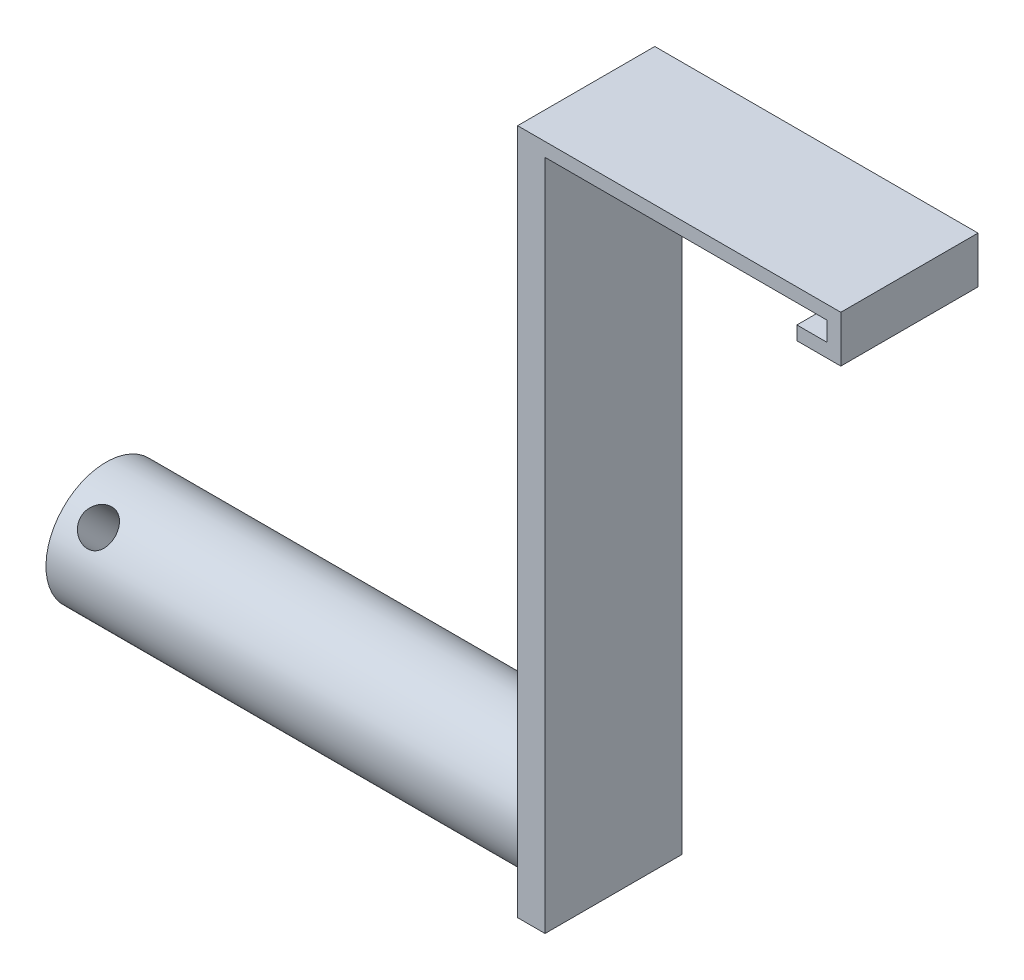
ISO-10303-21;
HEADER;
FILE_DESCRIPTION(('STEP AP214'),'2;1');
FILE_NAME('part.step','',(''),(''),'','','');
FILE_SCHEMA(('AUTOMOTIVE_DESIGN { 1 0 10303 214 1 1 1 1 }'));
ENDSEC;
DATA;
#1=APPLICATION_CONTEXT('core data for automotive mechanical design processes');
#2=APPLICATION_PROTOCOL_DEFINITION('international standard','automotive_design',2000,#1);
#3=PRODUCT_CONTEXT('',#1,'mechanical');
#4=PRODUCT('Part','Part','',(#3));
#5=PRODUCT_RELATED_PRODUCT_CATEGORY('part','',(#4));
#6=PRODUCT_DEFINITION_FORMATION('','',#4);
#7=PRODUCT_DEFINITION_CONTEXT('part definition',#1,'design');
#8=PRODUCT_DEFINITION('design','',#6,#7);
#9=PRODUCT_DEFINITION_SHAPE('','',#8);
#10=(LENGTH_UNIT() NAMED_UNIT(*) SI_UNIT(.MILLI.,.METRE.));
#11=(NAMED_UNIT(*) PLANE_ANGLE_UNIT() SI_UNIT($,.RADIAN.));
#12=(NAMED_UNIT(*) SI_UNIT($,.STERADIAN.) SOLID_ANGLE_UNIT());
#13=UNCERTAINTY_MEASURE_WITH_UNIT(LENGTH_MEASURE(1.E-05),#10,'distance_accuracy_value','');
#14=(GEOMETRIC_REPRESENTATION_CONTEXT(3) GLOBAL_UNCERTAINTY_ASSIGNED_CONTEXT((#13)) GLOBAL_UNIT_ASSIGNED_CONTEXT((#10,
#11,#12)) REPRESENTATION_CONTEXT('',''));
#15=CARTESIAN_POINT('',(0.,0.,0.));
#16=DIRECTION('',(0.,0.,1.));
#17=DIRECTION('',(1.,0.,0.));
#18=AXIS2_PLACEMENT_3D('',#15,#16,#17);
#19=CARTESIAN_POINT('',(0.,-2.54,25.4));
#20=DIRECTION('',(1.,0.,0.));
#21=DIRECTION('',(0.,0.,-1.));
#22=AXIS2_PLACEMENT_3D('',#19,#20,#21);
#23=PLANE('',#22);
#24=DIRECTION('',(0.,-1.,0.));
#25=VECTOR('',#24,1.);
#26=CARTESIAN_POINT('',(0.,-2.54,0.));
#27=LINE('',#26,#25);
#28=CARTESIAN_POINT('',(0.,0.,0.));
#29=VERTEX_POINT('',#28);
#30=CARTESIAN_POINT('',(0.,-2.54,0.));
#31=VERTEX_POINT('',#30);
#32=EDGE_CURVE('E151',#29,#31,#27,.T.);
#33=ORIENTED_EDGE('',*,*,#32,.T.);
#34=DIRECTION('',(0.,0.,-1.));
#35=VECTOR('',#34,1.);
#36=CARTESIAN_POINT('',(0.,-2.54,25.4));
#37=LINE('',#36,#35);
#38=CARTESIAN_POINT('',(0.,-2.54,25.4));
#39=VERTEX_POINT('',#38);
#40=EDGE_CURVE('E48',#39,#31,#37,.T.);
#41=ORIENTED_EDGE('',*,*,#40,.F.);
#42=DIRECTION('',(0.,-1.,0.));
#43=VECTOR('',#42,1.);
#44=CARTESIAN_POINT('',(0.,-2.54,25.4));
#45=LINE('',#44,#43);
#46=CARTESIAN_POINT('',(0.,0.,25.4));
#47=VERTEX_POINT('',#46);
#48=EDGE_CURVE('E171',#47,#39,#45,.T.);
#49=ORIENTED_EDGE('',*,*,#48,.F.);
#50=DIRECTION('',(0.,0.,-1.));
#51=VECTOR('',#50,1.);
#52=CARTESIAN_POINT('',(0.,0.,25.4));
#53=LINE('',#52,#51);
#54=EDGE_CURVE('E147',#47,#29,#53,.T.);
#55=ORIENTED_EDGE('',*,*,#54,.T.);
#56=EDGE_LOOP('',(#33,#41,#49,#55));
#57=FACE_BOUND('',#56,.T.);
#58=ADVANCED_FACE('F35',(#57),#23,.F.);
#59=CARTESIAN_POINT('',(8.128,-2.54,25.4));
#60=DIRECTION('',(0.,1.,0.));
#61=DIRECTION('',(-1.,0.,0.));
#62=AXIS2_PLACEMENT_3D('',#59,#60,#61);
#63=PLANE('',#62);
#64=DIRECTION('',(1.,0.,0.));
#65=VECTOR('',#64,1.);
#66=CARTESIAN_POINT('',(8.128,-2.54,0.));
#67=LINE('',#66,#65);
#68=CARTESIAN_POINT('',(8.128,-2.54,0.));
#69=VERTEX_POINT('',#68);
#70=EDGE_CURVE('E154',#31,#69,#67,.T.);
#71=ORIENTED_EDGE('',*,*,#70,.T.);
#72=DIRECTION('',(0.,0.,-1.));
#73=VECTOR('',#72,1.);
#74=CARTESIAN_POINT('',(8.128,-2.54,25.4));
#75=LINE('',#74,#73);
#76=CARTESIAN_POINT('',(8.128,-2.54,25.4));
#77=VERTEX_POINT('',#76);
#78=EDGE_CURVE('E188',#77,#69,#75,.T.);
#79=ORIENTED_EDGE('',*,*,#78,.F.);
#80=DIRECTION('',(1.,0.,0.));
#81=VECTOR('',#80,1.);
#82=CARTESIAN_POINT('',(8.128,-2.54,25.4));
#83=LINE('',#82,#81);
#84=EDGE_CURVE('E107',#39,#77,#83,.T.);
#85=ORIENTED_EDGE('',*,*,#84,.F.);
#86=ORIENTED_EDGE('',*,*,#40,.T.);
#87=EDGE_LOOP('',(#71,#79,#85,#86));
#88=FACE_BOUND('',#87,.T.);
#89=ADVANCED_FACE('F212',(#88),#63,.F.);
#90=CARTESIAN_POINT('',(8.128,6.09599999999999,25.4));
#91=DIRECTION('',(-1.,0.,0.));
#92=DIRECTION('',(0.,-1.,0.));
#93=AXIS2_PLACEMENT_3D('',#90,#91,#92);
#94=PLANE('',#93);
#95=DIRECTION('',(0.,1.,0.));
#96=VECTOR('',#95,1.);
#97=CARTESIAN_POINT('',(8.128,6.09599999999999,0.));
#98=LINE('',#97,#96);
#99=CARTESIAN_POINT('',(8.128,6.09599999999999,0.));
#100=VERTEX_POINT('',#99);
#101=EDGE_CURVE('E157',#69,#100,#98,.T.);
#102=ORIENTED_EDGE('',*,*,#101,.T.);
#103=DIRECTION('',(0.,0.,-1.));
#104=VECTOR('',#103,1.);
#105=CARTESIAN_POINT('',(8.128,6.09599999999999,25.4));
#106=LINE('',#105,#104);
#107=CARTESIAN_POINT('',(8.128,6.09599999999999,25.4));
#108=VERTEX_POINT('',#107);
#109=EDGE_CURVE('E185',#108,#100,#106,.T.);
#110=ORIENTED_EDGE('',*,*,#109,.F.);
#111=DIRECTION('',(0.,1.,0.));
#112=VECTOR('',#111,1.);
#113=CARTESIAN_POINT('',(8.128,6.09599999999999,25.4));
#114=LINE('',#113,#112);
#115=EDGE_CURVE('E227',#77,#108,#114,.T.);
#116=ORIENTED_EDGE('',*,*,#115,.F.);
#117=ORIENTED_EDGE('',*,*,#78,.T.);
#118=EDGE_LOOP('',(#102,#110,#116,#117));
#119=FACE_BOUND('',#118,.T.);
#120=ADVANCED_FACE('F217',(#119),#94,.F.);
#121=CARTESIAN_POINT('',(-51.7144,6.09599999999999,25.4));
#122=DIRECTION('',(0.,-1.,0.));
#123=DIRECTION('',(0.,0.,-1.));
#124=AXIS2_PLACEMENT_3D('',#121,#122,#123);
#125=PLANE('',#124);
#126=DIRECTION('',(-1.,0.,0.));
#127=VECTOR('',#126,1.);
#128=CARTESIAN_POINT('',(-51.7144,6.09599999999999,0.));
#129=LINE('',#128,#127);
#130=CARTESIAN_POINT('',(-51.7144,6.09599999999999,0.));
#131=VERTEX_POINT('',#130);
#132=EDGE_CURVE('E159',#100,#131,#129,.T.);
#133=ORIENTED_EDGE('',*,*,#132,.T.);
#134=DIRECTION('',(0.,0.,-1.));
#135=VECTOR('',#134,1.);
#136=CARTESIAN_POINT('',(-51.7144,6.09599999999999,25.4));
#137=LINE('',#136,#135);
#138=CARTESIAN_POINT('',(-51.7144,6.09599999999999,25.4));
#139=VERTEX_POINT('',#138);
#140=EDGE_CURVE('E182',#139,#131,#137,.T.);
#141=ORIENTED_EDGE('',*,*,#140,.F.);
#142=DIRECTION('',(-1.,0.,0.));
#143=VECTOR('',#142,1.);
#144=CARTESIAN_POINT('',(-51.7144,6.09599999999999,25.4));
#145=LINE('',#144,#143);
#146=EDGE_CURVE('E229',#108,#139,#145,.T.);
#147=ORIENTED_EDGE('',*,*,#146,.F.);
#148=ORIENTED_EDGE('',*,*,#109,.T.);
#149=EDGE_LOOP('',(#133,#141,#147,#148));
#150=FACE_BOUND('',#149,.T.);
#151=ADVANCED_FACE('F255',(#150),#125,.F.);
#152=CARTESIAN_POINT('',(-51.7144,-120.904,25.4));
#153=DIRECTION('',(1.,0.,0.));
#154=DIRECTION('',(0.,1.,0.));
#155=AXIS2_PLACEMENT_3D('',#152,#153,#154);
#156=PLANE('',#155);
#157=DIRECTION('',(0.,0.,-1.));
#158=VECTOR('',#157,1.);
#159=CARTESIAN_POINT('',(-51.7144,-120.904,25.4));
#160=LINE('',#159,#158);
#161=CARTESIAN_POINT('',(-51.7144,-120.904,12.7));
#162=VERTEX_POINT('',#161);
#163=CARTESIAN_POINT('',(-51.7144,-120.904,0.));
#164=VERTEX_POINT('',#163);
#165=EDGE_CURVE('E178',#162,#164,#160,.T.);
#166=ORIENTED_EDGE('',*,*,#165,.F.);
#167=CARTESIAN_POINT('',(-51.7144,-109.7788,12.7));
#168=DIRECTION('',(-1.,0.,0.));
#169=DIRECTION('',(0.,-1.,0.));
#170=AXIS2_PLACEMENT_3D('',#167,#168,#169);
#171=CIRCLE('',#170,11.1252);
#172=EDGE_CURVE('E363',#162,#162,#171,.T.);
#173=ORIENTED_EDGE('',*,*,#172,.F.);
#174=CARTESIAN_POINT('',(-51.7144,-120.904,25.4));
#175=VERTEX_POINT('',#174);
#176=EDGE_CURVE('E179',#175,#162,#160,.T.);
#177=ORIENTED_EDGE('',*,*,#176,.F.);
#178=DIRECTION('',(0.,-1.,0.));
#179=VECTOR('',#178,1.);
#180=CARTESIAN_POINT('',(-51.7144,-120.904,25.4));
#181=LINE('',#180,#179);
#182=EDGE_CURVE('E231',#139,#175,#181,.T.);
#183=ORIENTED_EDGE('',*,*,#182,.F.);
#184=ORIENTED_EDGE('',*,*,#140,.T.);
#185=DIRECTION('',(0.,-1.,0.));
#186=VECTOR('',#185,1.);
#187=CARTESIAN_POINT('',(-51.7144,-120.904,0.));
#188=LINE('',#187,#186);
#189=EDGE_CURVE('E161',#131,#164,#188,.T.);
#190=ORIENTED_EDGE('',*,*,#189,.T.);
#191=EDGE_LOOP('',(#166,#173,#177,#183,#184,#190));
#192=FACE_BOUND('',#191,.T.);
#193=ADVANCED_FACE('F251',(#192),#156,.F.);
#194=CARTESIAN_POINT('',(-46.6344,-120.904,25.4));
#195=DIRECTION('',(0.,1.,0.));
#196=DIRECTION('',(0.,0.,1.));
#197=AXIS2_PLACEMENT_3D('',#194,#195,#196);
#198=PLANE('',#197);
#199=DIRECTION('',(1.,0.,0.));
#200=VECTOR('',#199,1.);
#201=CARTESIAN_POINT('',(-46.6344,-120.904,0.));
#202=LINE('',#201,#200);
#203=CARTESIAN_POINT('',(-46.6344,-120.904,0.));
#204=VERTEX_POINT('',#203);
#205=EDGE_CURVE('E164',#164,#204,#202,.T.);
#206=ORIENTED_EDGE('',*,*,#205,.T.);
#207=DIRECTION('',(0.,0.,-1.));
#208=VECTOR('',#207,1.);
#209=CARTESIAN_POINT('',(-46.6344,-120.904,25.4));
#210=LINE('',#209,#208);
#211=CARTESIAN_POINT('',(-46.6344,-120.904,25.4));
#212=VERTEX_POINT('',#211);
#213=EDGE_CURVE('E175',#212,#204,#210,.T.);
#214=ORIENTED_EDGE('',*,*,#213,.F.);
#215=DIRECTION('',(1.,0.,0.));
#216=VECTOR('',#215,1.);
#217=CARTESIAN_POINT('',(-46.6344,-120.904,25.4));
#218=LINE('',#217,#216);
#219=EDGE_CURVE('E237',#175,#212,#218,.T.);
#220=ORIENTED_EDGE('',*,*,#219,.F.);
#221=ORIENTED_EDGE('',*,*,#176,.T.);
#222=ORIENTED_EDGE('',*,*,#165,.T.);
#223=EDGE_LOOP('',(#206,#214,#220,#221,#222));
#224=FACE_BOUND('',#223,.T.);
#225=ADVANCED_FACE('F243',(#224),#198,.F.);
#226=CARTESIAN_POINT('',(-46.6344,3.55599999999998,25.4));
#227=DIRECTION('',(-1.,0.,0.));
#228=DIRECTION('',(0.,-1.,0.));
#229=AXIS2_PLACEMENT_3D('',#226,#227,#228);
#230=PLANE('',#229);
#231=DIRECTION('',(0.,1.,0.));
#232=VECTOR('',#231,1.);
#233=CARTESIAN_POINT('',(-46.6344,3.55599999999998,0.));
#234=LINE('',#233,#232);
#235=CARTESIAN_POINT('',(-46.6344,3.55599999999998,0.));
#236=VERTEX_POINT('',#235);
#237=EDGE_CURVE('E166',#204,#236,#234,.T.);
#238=ORIENTED_EDGE('',*,*,#237,.T.);
#239=DIRECTION('',(0.,0.,-1.));
#240=VECTOR('',#239,1.);
#241=CARTESIAN_POINT('',(-46.6344,3.55599999999998,25.4));
#242=LINE('',#241,#240);
#243=CARTESIAN_POINT('',(-46.6344,3.55599999999998,25.4));
#244=VERTEX_POINT('',#243);
#245=EDGE_CURVE('E142',#244,#236,#242,.T.);
#246=ORIENTED_EDGE('',*,*,#245,.F.);
#247=DIRECTION('',(0.,1.,0.));
#248=VECTOR('',#247,1.);
#249=CARTESIAN_POINT('',(-46.6344,3.55599999999998,25.4));
#250=LINE('',#249,#248);
#251=EDGE_CURVE('E133',#212,#244,#250,.T.);
#252=ORIENTED_EDGE('',*,*,#251,.F.);
#253=ORIENTED_EDGE('',*,*,#213,.T.);
#254=EDGE_LOOP('',(#238,#246,#252,#253));
#255=FACE_BOUND('',#254,.T.);
#256=ADVANCED_FACE('F247',(#255),#230,.F.);
#257=CARTESIAN_POINT('',(5.588,3.55599999999999,25.4));
#258=DIRECTION('',(0.,1.,0.));
#259=DIRECTION('',(-1.,0.,0.));
#260=AXIS2_PLACEMENT_3D('',#257,#258,#259);
#261=PLANE('',#260);
#262=DIRECTION('',(1.,0.,0.));
#263=VECTOR('',#262,1.);
#264=CARTESIAN_POINT('',(5.588,3.55599999999999,0.));
#265=LINE('',#264,#263);
#266=CARTESIAN_POINT('',(5.588,3.55599999999999,0.));
#267=VERTEX_POINT('',#266);
#268=EDGE_CURVE('E141',#236,#267,#265,.T.);
#269=ORIENTED_EDGE('',*,*,#268,.T.);
#270=DIRECTION('',(0.,0.,-1.));
#271=VECTOR('',#270,1.);
#272=CARTESIAN_POINT('',(5.588,3.55599999999999,25.4));
#273=LINE('',#272,#271);
#274=CARTESIAN_POINT('',(5.588,3.55599999999999,25.4));
#275=VERTEX_POINT('',#274);
#276=EDGE_CURVE('E138',#275,#267,#273,.T.);
#277=ORIENTED_EDGE('',*,*,#276,.F.);
#278=DIRECTION('',(1.,0.,0.));
#279=VECTOR('',#278,1.);
#280=CARTESIAN_POINT('',(5.588,3.55599999999999,25.4));
#281=LINE('',#280,#279);
#282=EDGE_CURVE('E127',#244,#275,#281,.T.);
#283=ORIENTED_EDGE('',*,*,#282,.F.);
#284=ORIENTED_EDGE('',*,*,#245,.T.);
#285=EDGE_LOOP('',(#269,#277,#283,#284));
#286=FACE_BOUND('',#285,.T.);
#287=ADVANCED_FACE('F139',(#286),#261,.F.);
#288=CARTESIAN_POINT('',(5.588,0.,25.4));
#289=DIRECTION('',(1.,0.,0.));
#290=DIRECTION('',(0.,1.,0.));
#291=AXIS2_PLACEMENT_3D('',#288,#289,#290);
#292=PLANE('',#291);
#293=DIRECTION('',(0.,-1.,0.));
#294=VECTOR('',#293,1.);
#295=CARTESIAN_POINT('',(5.588,0.,0.));
#296=LINE('',#295,#294);
#297=CARTESIAN_POINT('',(5.588,0.,0.));
#298=VERTEX_POINT('',#297);
#299=EDGE_CURVE('E92',#267,#298,#296,.T.);
#300=ORIENTED_EDGE('',*,*,#299,.T.);
#301=DIRECTION('',(0.,0.,-1.));
#302=VECTOR('',#301,1.);
#303=CARTESIAN_POINT('',(5.588,0.,25.4));
#304=LINE('',#303,#302);
#305=CARTESIAN_POINT('',(5.588,0.,25.4));
#306=VERTEX_POINT('',#305);
#307=EDGE_CURVE('E143',#306,#298,#304,.T.);
#308=ORIENTED_EDGE('',*,*,#307,.F.);
#309=DIRECTION('',(0.,-1.,0.));
#310=VECTOR('',#309,1.);
#311=CARTESIAN_POINT('',(5.588,0.,25.4));
#312=LINE('',#311,#310);
#313=EDGE_CURVE('E131',#275,#306,#312,.T.);
#314=ORIENTED_EDGE('',*,*,#313,.F.);
#315=ORIENTED_EDGE('',*,*,#276,.T.);
#316=EDGE_LOOP('',(#300,#308,#314,#315));
#317=FACE_BOUND('',#316,.T.);
#318=ADVANCED_FACE('F145',(#317),#292,.F.);
#319=CARTESIAN_POINT('',(0.,0.,25.4));
#320=DIRECTION('',(0.,-1.,0.));
#321=DIRECTION('',(0.,0.,-1.));
#322=AXIS2_PLACEMENT_3D('',#319,#320,#321);
#323=PLANE('',#322);
#324=DIRECTION('',(-1.,0.,0.));
#325=VECTOR('',#324,1.);
#326=CARTESIAN_POINT('',(0.,0.,0.));
#327=LINE('',#326,#325);
#328=EDGE_CURVE('E98',#298,#29,#327,.T.);
#329=ORIENTED_EDGE('',*,*,#328,.T.);
#330=ORIENTED_EDGE('',*,*,#54,.F.);
#331=DIRECTION('',(-1.,0.,0.));
#332=VECTOR('',#331,1.);
#333=CARTESIAN_POINT('',(0.,0.,25.4));
#334=LINE('',#333,#332);
#335=EDGE_CURVE('E56',#306,#47,#334,.T.);
#336=ORIENTED_EDGE('',*,*,#335,.F.);
#337=ORIENTED_EDGE('',*,*,#307,.T.);
#338=EDGE_LOOP('',(#329,#330,#336,#337));
#339=FACE_BOUND('',#338,.T.);
#340=ADVANCED_FACE('F273',(#339),#323,.F.);
#341=CARTESIAN_POINT('',(0.,0.,25.4));
#342=DIRECTION('',(0.,0.,-1.));
#343=DIRECTION('',(-1.,0.,0.));
#344=AXIS2_PLACEMENT_3D('',#341,#342,#343);
#345=PLANE('',#344);
#346=ORIENTED_EDGE('',*,*,#48,.T.);
#347=ORIENTED_EDGE('',*,*,#84,.T.);
#348=ORIENTED_EDGE('',*,*,#115,.T.);
#349=ORIENTED_EDGE('',*,*,#146,.T.);
#350=ORIENTED_EDGE('',*,*,#182,.T.);
#351=ORIENTED_EDGE('',*,*,#219,.T.);
#352=ORIENTED_EDGE('',*,*,#251,.T.);
#353=ORIENTED_EDGE('',*,*,#282,.T.);
#354=ORIENTED_EDGE('',*,*,#313,.T.);
#355=ORIENTED_EDGE('',*,*,#335,.T.);
#356=EDGE_LOOP('',(#346,#347,#348,#349,#350,#351,#352,#353,#354,#355));
#357=FACE_BOUND('',#356,.T.);
#358=ADVANCED_FACE('F129',(#357),#345,.F.);
#359=CARTESIAN_POINT('',(0.,0.,0.));
#360=DIRECTION('',(0.,0.,-1.));
#361=DIRECTION('',(-1.,0.,0.));
#362=AXIS2_PLACEMENT_3D('',#359,#360,#361);
#363=PLANE('',#362);
#364=ORIENTED_EDGE('',*,*,#32,.F.);
#365=ORIENTED_EDGE('',*,*,#328,.F.);
#366=ORIENTED_EDGE('',*,*,#299,.F.);
#367=ORIENTED_EDGE('',*,*,#268,.F.);
#368=ORIENTED_EDGE('',*,*,#237,.F.);
#369=ORIENTED_EDGE('',*,*,#205,.F.);
#370=ORIENTED_EDGE('',*,*,#189,.F.);
#371=ORIENTED_EDGE('',*,*,#132,.F.);
#372=ORIENTED_EDGE('',*,*,#101,.F.);
#373=ORIENTED_EDGE('',*,*,#70,.F.);
#374=EDGE_LOOP('',(#364,#365,#366,#367,#368,#369,#370,#371,#372,#373));
#375=FACE_BOUND('',#374,.T.);
#376=ADVANCED_FACE('F208',(#375),#363,.T.);
#377=CARTESIAN_POINT('',(-140.6144,-109.7788,12.7));
#378=DIRECTION('',(1.,0.,0.));
#379=DIRECTION('',(0.,1.,0.));
#380=AXIS2_PLACEMENT_3D('',#377,#378,#379);
#381=CYLINDRICAL_SURFACE('',#380,11.1252);
#382=CARTESIAN_POINT('',(-134.2644,-119.563408115953,7.40551994458148));
#383=CARTESIAN_POINT('',(-134.090001550706,-119.563407614243,7.40551597315297));
#384=CARTESIAN_POINT('',(-133.91557110886,-119.556271588709,7.39226615864977));
#385=CARTESIAN_POINT('',(-133.571781849876,-119.527715645985,7.34000204409121));
#386=CARTESIAN_POINT('',(-133.40242513351,-119.506289895277,7.30097722192628));
#387=CARTESIAN_POINT('',(-133.073807956537,-119.449172467906,7.1993330580408));
#388=CARTESIAN_POINT('',(-132.914532328844,-119.413502842267,7.13675019520458));
#389=CARTESIAN_POINT('',(-132.609864312679,-119.327860740213,6.99100446635465));
#390=CARTESIAN_POINT('',(-132.464473565519,-119.277886575662,6.90783917148278));
#391=CARTESIAN_POINT('',(-132.187538802828,-119.162147908142,6.72211518671356));
#392=CARTESIAN_POINT('',(-132.05645128786,-119.096007748252,6.61910975566576));
#393=CARTESIAN_POINT('',(-131.81589619582,-118.948838545607,6.39937076459404));
#394=CARTESIAN_POINT('',(-131.706431144998,-118.867807765245,6.28263560300291));
#395=CARTESIAN_POINT('',(-131.510281675772,-118.689783179352,6.03758486772901));
#396=CARTESIAN_POINT('',(-131.424057468593,-118.592521160314,5.90909465617599));
#397=CARTESIAN_POINT('',(-131.279849621418,-118.384465308768,5.64730482856858));
#398=CARTESIAN_POINT('',(-131.221860496283,-118.273674109763,5.51400615204768));
#399=CARTESIAN_POINT('',(-131.137264563591,-118.043878616905,5.25095690125879));
#400=CARTESIAN_POINT('',(-131.109879731295,-117.925163391741,5.12120433980782));
#401=CARTESIAN_POINT('',(-131.084815183471,-117.680141644676,4.86609105543865));
#402=CARTESIAN_POINT('',(-131.087129802216,-117.553836575255,4.74072949942931));
#403=CARTESIAN_POINT('',(-131.12086460044,-117.301210596418,4.50165822713473));
#404=CARTESIAN_POINT('',(-131.151443158712,-117.174995270355,4.38771669662732));
#405=CARTESIAN_POINT('',(-131.239469884216,-116.923032244499,4.170185219977));
#406=CARTESIAN_POINT('',(-131.296919684717,-116.797284573598,4.06659590351957));
#407=CARTESIAN_POINT('',(-131.43766145281,-116.549054224731,3.87055822318716));
#408=CARTESIAN_POINT('',(-131.521228701823,-116.426622179709,3.77824383608282));
#409=CARTESIAN_POINT('',(-131.71161854045,-116.190672787193,3.60718796067656));
#410=CARTESIAN_POINT('',(-131.818446216462,-116.07715739692,3.52844944779276));
#411=CARTESIAN_POINT('',(-132.056736858803,-115.85937018696,3.38256805190501));
#412=CARTESIAN_POINT('',(-132.188931492214,-115.755561245043,3.31592776564124));
#413=CARTESIAN_POINT('',(-132.471921173663,-115.566159284514,3.19794588892509));
#414=CARTESIAN_POINT('',(-132.622717722279,-115.480567736981,3.14660553382926));
#415=CARTESIAN_POINT('',(-132.940283408954,-115.330954068442,3.05887584288236));
#416=CARTESIAN_POINT('',(-133.107169991318,-115.267108822047,3.02260860427036));
#417=CARTESIAN_POINT('',(-133.451176292511,-115.165336398012,2.96558979009132));
#418=CARTESIAN_POINT('',(-133.628293025617,-115.127401699282,2.9448337119143));
#419=CARTESIAN_POINT('',(-133.981284709674,-115.080453180907,2.91924113361788));
#420=CARTESIAN_POINT('',(-134.156997512398,-115.070500826524,2.91388787003844));
#421=CARTESIAN_POINT('',(-134.507727688189,-115.077394393787,2.91761838858923));
#422=CARTESIAN_POINT('',(-134.682745145057,-115.094236981503,2.92670037462998));
#423=CARTESIAN_POINT('',(-135.022974567152,-115.153064508809,2.95893096609568));
#424=CARTESIAN_POINT('',(-135.188319171625,-115.19446666246,2.98175369277514));
#425=CARTESIAN_POINT('',(-135.509037623214,-115.299805851781,3.04121107201979));
#426=CARTESIAN_POINT('',(-135.664410030127,-115.363746133831,3.07784771438702));
#427=CARTESIAN_POINT('',(-135.965013213394,-115.513039134277,3.16604756401118));
#428=CARTESIAN_POINT('',(-136.109898787841,-115.598881640854,3.2179570413367));
#429=CARTESIAN_POINT('',(-136.381645248601,-115.787445520046,3.33631363061016));
#430=CARTESIAN_POINT('',(-136.50850222708,-115.890170541699,3.40276388647704));
#431=CARTESIAN_POINT('',(-136.744987259621,-116.11219043676,3.55250131771331));
#432=CARTESIAN_POINT('',(-136.85389103577,-116.231926898044,3.63628023521569));
#433=CARTESIAN_POINT('',(-137.046009637089,-116.480517257763,3.81851496224108));
#434=CARTESIAN_POINT('',(-137.129225805959,-116.609370678862,3.91697000366711));
#435=CARTESIAN_POINT('',(-137.266812980345,-116.870372450615,4.12635309765307));
#436=CARTESIAN_POINT('',(-137.321402290397,-117.00248757379,4.23717869655105));
#437=CARTESIAN_POINT('',(-137.400784201485,-117.266199152244,4.46958232700612));
#438=CARTESIAN_POINT('',(-137.425584448602,-117.397795731971,4.59115759079698));
#439=CARTESIAN_POINT('',(-137.444148347101,-117.651477837922,4.83735567505013));
#440=CARTESIAN_POINT('',(-137.43896749462,-117.773735041054,4.96172306082834));
#441=CARTESIAN_POINT('',(-137.400206729704,-118.010138008539,5.21367963477736));
#442=CARTESIAN_POINT('',(-137.366628171824,-118.124284159503,5.34126866899557));
#443=CARTESIAN_POINT('',(-137.272654603365,-118.340807244353,5.59439462732825));
#444=CARTESIAN_POINT('',(-137.212500956346,-118.443279896027,5.71993970859648));
#445=CARTESIAN_POINT('',(-137.067299457267,-118.635872894333,5.96599860316758));
#446=CARTESIAN_POINT('',(-136.982247756943,-118.725991328321,6.08651163542004));
#447=CARTESIAN_POINT('',(-136.786729354649,-118.895328622647,6.32186256691857));
#448=CARTESIAN_POINT('',(-136.675583155022,-118.974144516188,6.43642580333031));
#449=CARTESIAN_POINT('',(-136.432283508775,-119.11709742129,6.65161185458463));
#450=CARTESIAN_POINT('',(-136.300124263319,-119.181230368938,6.7522308069241));
#451=CARTESIAN_POINT('',(-136.014390858866,-119.296141346793,6.93783547109476));
#452=CARTESIAN_POINT('',(-135.86034649285,-119.346525621215,7.02234273135088));
#453=CARTESIAN_POINT('',(-135.537739916417,-119.431646104528,7.16828963966861));
#454=CARTESIAN_POINT('',(-135.369185921041,-119.466391099527,7.22974223654268));
#455=CARTESIAN_POINT('',(-135.045481641281,-119.516711657195,7.31990297803389));
#456=CARTESIAN_POINT('',(-134.891534623701,-119.534223540861,7.35188139694435));
#457=CARTESIAN_POINT('',(-134.579866731511,-119.557571080853,7.3946900167333));
#458=CARTESIAN_POINT('',(-134.42214645314,-119.563408569758,7.40552353680815));
#459=CARTESIAN_POINT('',(-134.2644,-119.563408115953,7.40551994458148));
#460=B_SPLINE_CURVE_WITH_KNOTS('',3,(#382,#383,#384,#385,#386,#387,#388,#389,#390,#391,#392,
#393,#394,#395,#396,#397,#398,#399,#400,#401,#402,#403,#404,#405,#406,#407,#408,#409,#410,#411,
#412,#413,#414,#415,#416,#417,#418,#419,#420,#421,#422,#423,#424,#425,#426,#427,#428,#429,#430,
#431,#432,#433,#434,#435,#436,#437,#438,#439,#440,#441,#442,#443,#444,#445,#446,#447,#448,#449,
#450,#451,#452,#453,#454,#455,#456,#457,#458,#459),.UNSPECIFIED.,.T.,.F.,(4,2,2,2,2,2,2,2,2,2,2,
2,2,2,2,2,2,2,2,2,2,2,2,2,2,2,2,2,2,2,2,2,2,2,2,2,2,2,4),(0.,0.522614304091669,1.0454420865533,
1.56746359486537,2.08954673443953,2.62516014552877,3.1608360977761,3.70644810646346,
4.25195407855389,4.78325217954708,5.31444892697828,5.83032066149293,6.34622375543294,
6.86775916070227,7.38940872574716,7.9293250207098,8.46928489812529,9.01353717565963,
9.55763140514523,10.0832454874892,10.6087941760193,11.122344435094,11.6359686959212,
12.162276952878,12.688699117651,13.2328533966993,13.7769792066092,14.3168929248892,
14.856668031637,15.3775584596069,15.8984240427699,16.4146532121601,16.9309622125422,
17.4625978665432,17.9943804881124,18.5400905180829,19.0854935857049,19.5582816021658,
20.0309953972964),.UNSPECIFIED.);
#461=CARTESIAN_POINT('',(-134.2644,-119.563408115953,7.40551994458148));
#462=VERTEX_POINT('',#461);
#463=EDGE_CURVE('E38',#462,#462,#460,.T.);
#464=ORIENTED_EDGE('',*,*,#463,.T.);
#465=EDGE_LOOP('',(#464));
#466=FACE_BOUND('',#465,.T.);
#467=CARTESIAN_POINT('',(-134.2644,-104.484319944581,22.4846081159531));
#468=CARTESIAN_POINT('',(-134.438798449294,-104.484315973153,22.4846076142434));
#469=CARTESIAN_POINT('',(-134.61322889114,-104.47106615865,22.477471588709));
#470=CARTESIAN_POINT('',(-134.957018150124,-104.418802044091,22.4489156459845));
#471=CARTESIAN_POINT('',(-135.12637486649,-104.379777221926,22.4274898952769));
#472=CARTESIAN_POINT('',(-135.454992043463,-104.278133058041,22.3703724679062));
#473=CARTESIAN_POINT('',(-135.614267671156,-104.215550195205,22.3347028422668));
#474=CARTESIAN_POINT('',(-135.918935687321,-104.069804466355,22.2490607402125));
#475=CARTESIAN_POINT('',(-136.064326434481,-103.986639171483,22.1990865756617));
#476=CARTESIAN_POINT('',(-136.341261197172,-103.800915186714,22.0833479081423));
#477=CARTESIAN_POINT('',(-136.47234871214,-103.697909755666,22.0172077482523));
#478=CARTESIAN_POINT('',(-136.71290380418,-103.478170764594,21.8700385456065));
#479=CARTESIAN_POINT('',(-136.822368855002,-103.361435603003,21.7890077652449));
#480=CARTESIAN_POINT('',(-137.018518324228,-103.116384867729,21.6109831793517));
#481=CARTESIAN_POINT('',(-137.104742531407,-102.987894656176,21.5137211603143));
#482=CARTESIAN_POINT('',(-137.248950378582,-102.726104828569,21.3056653087677));
#483=CARTESIAN_POINT('',(-137.306939503716,-102.592806152048,21.1948741097633));
#484=CARTESIAN_POINT('',(-137.391535436409,-102.329756901259,20.9650786169051));
#485=CARTESIAN_POINT('',(-137.418920268705,-102.200004339808,20.8463633917411));
#486=CARTESIAN_POINT('',(-137.443984816529,-101.944891055439,20.6013416446757));
#487=CARTESIAN_POINT('',(-137.441670197784,-101.819529499429,20.475036575255));
#488=CARTESIAN_POINT('',(-137.40793539956,-101.580458227135,20.2224105964182));
#489=CARTESIAN_POINT('',(-137.377356841288,-101.466516696627,20.096195270355));
#490=CARTESIAN_POINT('',(-137.289330115784,-101.248985219977,19.8442322444985));
#491=CARTESIAN_POINT('',(-137.231880315283,-101.14539590352,19.7184845735983));
#492=CARTESIAN_POINT('',(-137.09113854719,-100.949358223187,19.4702542247307));
#493=CARTESIAN_POINT('',(-137.007571298177,-100.857043836083,19.3478221797085));
#494=CARTESIAN_POINT('',(-136.81718145955,-100.685987960677,19.1118727871934));
#495=CARTESIAN_POINT('',(-136.710353783538,-100.607249447793,18.9983573969201));
#496=CARTESIAN_POINT('',(-136.472063141197,-100.461368051905,18.7805701869603));
#497=CARTESIAN_POINT('',(-136.339868507786,-100.394727765641,18.6767612450434));
#498=CARTESIAN_POINT('',(-136.056878826337,-100.276745888925,18.487359284514));
#499=CARTESIAN_POINT('',(-135.906082277721,-100.225405533829,18.4017677369809));
#500=CARTESIAN_POINT('',(-135.588516591046,-100.137675842882,18.2521540684417));
#501=CARTESIAN_POINT('',(-135.421630008682,-100.10140860427,18.1883088220471));
#502=CARTESIAN_POINT('',(-135.077623707489,-100.044389790091,18.0865363980117));
#503=CARTESIAN_POINT('',(-134.900506974383,-100.023633711914,18.0486016992817));
#504=CARTESIAN_POINT('',(-134.547515290326,-99.9980411336179,18.0016531809065));
#505=CARTESIAN_POINT('',(-134.371802487602,-99.9926878700384,17.9917008265237));
#506=CARTESIAN_POINT('',(-134.021072311811,-99.9964183885892,17.9985943937871));
#507=CARTESIAN_POINT('',(-133.846054854943,-100.00550037463,18.0154369815034));
#508=CARTESIAN_POINT('',(-133.505825432848,-100.037730966096,18.074264508809));
#509=CARTESIAN_POINT('',(-133.340480828375,-100.060553692775,18.1156666624602));
#510=CARTESIAN_POINT('',(-133.019762376786,-100.12001107202,18.2210058517811));
#511=CARTESIAN_POINT('',(-132.864389969873,-100.156647714387,18.2849461338308));
#512=CARTESIAN_POINT('',(-132.563786786606,-100.244847564011,18.4342391342771));
#513=CARTESIAN_POINT('',(-132.418901212159,-100.296757041337,18.5200816408539));
#514=CARTESIAN_POINT('',(-132.147154751399,-100.41511363061,18.7086455200461));
#515=CARTESIAN_POINT('',(-132.02029777292,-100.481563886477,18.811370541699));
#516=CARTESIAN_POINT('',(-131.783812740379,-100.631301317713,19.0333904367595));
#517=CARTESIAN_POINT('',(-131.67490896423,-100.715080235216,19.1531268980439));
#518=CARTESIAN_POINT('',(-131.482790362911,-100.897314962241,19.4017172577628));
#519=CARTESIAN_POINT('',(-131.399574194041,-100.995770003667,19.5305706788623));
#520=CARTESIAN_POINT('',(-131.261987019655,-101.205153097653,19.7915724506147));
#521=CARTESIAN_POINT('',(-131.207397709603,-101.315978696551,19.9236875737904));
#522=CARTESIAN_POINT('',(-131.128015798515,-101.548382327006,20.1873991522436));
#523=CARTESIAN_POINT('',(-131.103215551398,-101.669957590797,20.3189957319705));
#524=CARTESIAN_POINT('',(-131.084651652899,-101.91615567505,20.5726778379223));
#525=CARTESIAN_POINT('',(-131.08983250538,-102.040523060828,20.6949350410538));
#526=CARTESIAN_POINT('',(-131.128593270296,-102.292479634777,20.9313380085385));
#527=CARTESIAN_POINT('',(-131.162171828176,-102.420068668996,21.0454841595033));
#528=CARTESIAN_POINT('',(-131.256145396635,-102.673194627328,21.2620072443527));
#529=CARTESIAN_POINT('',(-131.316299043654,-102.798739708596,21.3644798960273));
#530=CARTESIAN_POINT('',(-131.461500542733,-103.044798603168,21.5570728943327));
#531=CARTESIAN_POINT('',(-131.546552243057,-103.16531163542,21.6471913283211));
#532=CARTESIAN_POINT('',(-131.742070645351,-103.400662566919,21.8165286226472));
#533=CARTESIAN_POINT('',(-131.853216844978,-103.51522580333,21.8953445161878));
#534=CARTESIAN_POINT('',(-132.096516491225,-103.730411854585,22.0382974212902));
#535=CARTESIAN_POINT('',(-132.228675736681,-103.831030806924,22.1024303689378));
#536=CARTESIAN_POINT('',(-132.514409141134,-104.016635471095,22.2173413467934));
#537=CARTESIAN_POINT('',(-132.66845350715,-104.101142731351,22.2677256212154));
#538=CARTESIAN_POINT('',(-132.991060083582,-104.247089639669,22.3528461045281));
#539=CARTESIAN_POINT('',(-133.159614078959,-104.308542236543,22.3875910995269));
#540=CARTESIAN_POINT('',(-133.483318358719,-104.398702978034,22.4379116571951));
#541=CARTESIAN_POINT('',(-133.637265376299,-104.430681396944,22.455423540861));
#542=CARTESIAN_POINT('',(-133.948933268489,-104.473490016733,22.4787710808534));
#543=CARTESIAN_POINT('',(-134.10665354686,-104.484323536808,22.4846085697583));
#544=CARTESIAN_POINT('',(-134.2644,-104.484319944581,22.4846081159531));
#545=B_SPLINE_CURVE_WITH_KNOTS('',3,(#467,#468,#469,#470,#471,#472,#473,#474,#475,#476,#477,
#478,#479,#480,#481,#482,#483,#484,#485,#486,#487,#488,#489,#490,#491,#492,#493,#494,#495,#496,
#497,#498,#499,#500,#501,#502,#503,#504,#505,#506,#507,#508,#509,#510,#511,#512,#513,#514,#515,
#516,#517,#518,#519,#520,#521,#522,#523,#524,#525,#526,#527,#528,#529,#530,#531,#532,#533,#534,
#535,#536,#537,#538,#539,#540,#541,#542,#543,#544),.UNSPECIFIED.,.T.,.F.,(4,2,2,2,2,2,2,2,2,2,2,
2,2,2,2,2,2,2,2,2,2,2,2,2,2,2,2,2,2,2,2,2,2,2,2,2,2,2,4),(0.,0.522614304091669,1.0454420865533,
1.56746359486538,2.08954673443954,2.62516014552877,3.1608360977761,3.70644810646345,
4.2519540785539,4.78325217954708,5.31444892697827,5.83032066149293,6.34622375543295,
6.86775916070227,7.38940872574716,7.92932502070977,8.46928489812529,9.01353717565963,
9.55763140514523,10.0832454874892,10.6087941760193,11.122344435094,11.6359686959212,
12.162276952878,12.688699117651,13.2328533966993,13.7769792066092,14.3168929248892,
14.856668031637,15.3775584596069,15.8984240427699,16.4146532121601,16.9309622125422,
17.4625978665431,17.9943804881125,18.5400905180829,19.0854935857049,19.5582816021658,
20.0309953972964),.UNSPECIFIED.);
#546=CARTESIAN_POINT('',(-134.2644,-104.484319944581,22.4846081159531));
#547=VERTEX_POINT('',#546);
#548=EDGE_CURVE('E11',#547,#547,#545,.T.);
#549=ORIENTED_EDGE('',*,*,#548,.T.);
#550=EDGE_LOOP('',(#549));
#551=FACE_BOUND('',#550,.T.);
#552=CARTESIAN_POINT('',(-140.6144,-109.7788,12.7));
#553=DIRECTION('',(-1.,0.,0.));
#554=DIRECTION('',(0.,-1.,0.));
#555=AXIS2_PLACEMENT_3D('',#552,#553,#554);
#556=CIRCLE('',#555,11.1252);
#557=CARTESIAN_POINT('',(-140.6144,-120.904,12.7));
#558=VERTEX_POINT('',#557);
#559=EDGE_CURVE('E155',#558,#558,#556,.T.);
#560=ORIENTED_EDGE('',*,*,#559,.F.);
#561=EDGE_LOOP('',(#560));
#562=FACE_BOUND('',#561,.T.);
#563=ORIENTED_EDGE('',*,*,#172,.T.);
#564=EDGE_LOOP('',(#563));
#565=FACE_BOUND('',#564,.T.);
#566=ADVANCED_FACE('F193',(#466,#551,#562,#565),#381,.T.);
#567=CARTESIAN_POINT('',(-140.6144,-109.7788,12.7));
#568=DIRECTION('',(-1.,0.,0.));
#569=DIRECTION('',(0.,-1.,0.));
#570=AXIS2_PLACEMENT_3D('',#567,#568,#569);
#571=PLANE('',#570);
#572=ORIENTED_EDGE('',*,*,#559,.T.);
#573=EDGE_LOOP('',(#572));
#574=FACE_BOUND('',#573,.T.);
#575=ADVANCED_FACE('F200',(#574),#571,.T.);
#576=CARTESIAN_POINT('',(-134.2644,-121.6914,0.787400000000018));
#577=DIRECTION('',(0.,0.707106781186549,0.707106781186546));
#578=DIRECTION('',(0.,-0.707106781186546,0.707106781186549));
#579=AXIS2_PLACEMENT_3D('',#576,#577,#578);
#580=CYLINDRICAL_SURFACE('',#579,3.175);
#581=ORIENTED_EDGE('',*,*,#548,.F.);
#582=EDGE_LOOP('',(#581));
#583=FACE_BOUND('',#582,.T.);
#584=ORIENTED_EDGE('',*,*,#463,.F.);
#585=EDGE_LOOP('',(#584));
#586=FACE_BOUND('',#585,.T.);
#587=ADVANCED_FACE('F197',(#583,#586),#580,.F.);
#588=CLOSED_SHELL('',(#58,#89,#120,#151,#193,#225,#256,#287,#318,#340,#358,#376,#566,#575,#587));
#589=MANIFOLD_SOLID_BREP('B2',#588);
#590=ADVANCED_BREP_SHAPE_REPRESENTATION('',(#18,#589),#14);
#591=SHAPE_DEFINITION_REPRESENTATION(#9,#590);
ENDSEC;
END-ISO-10303-21;
